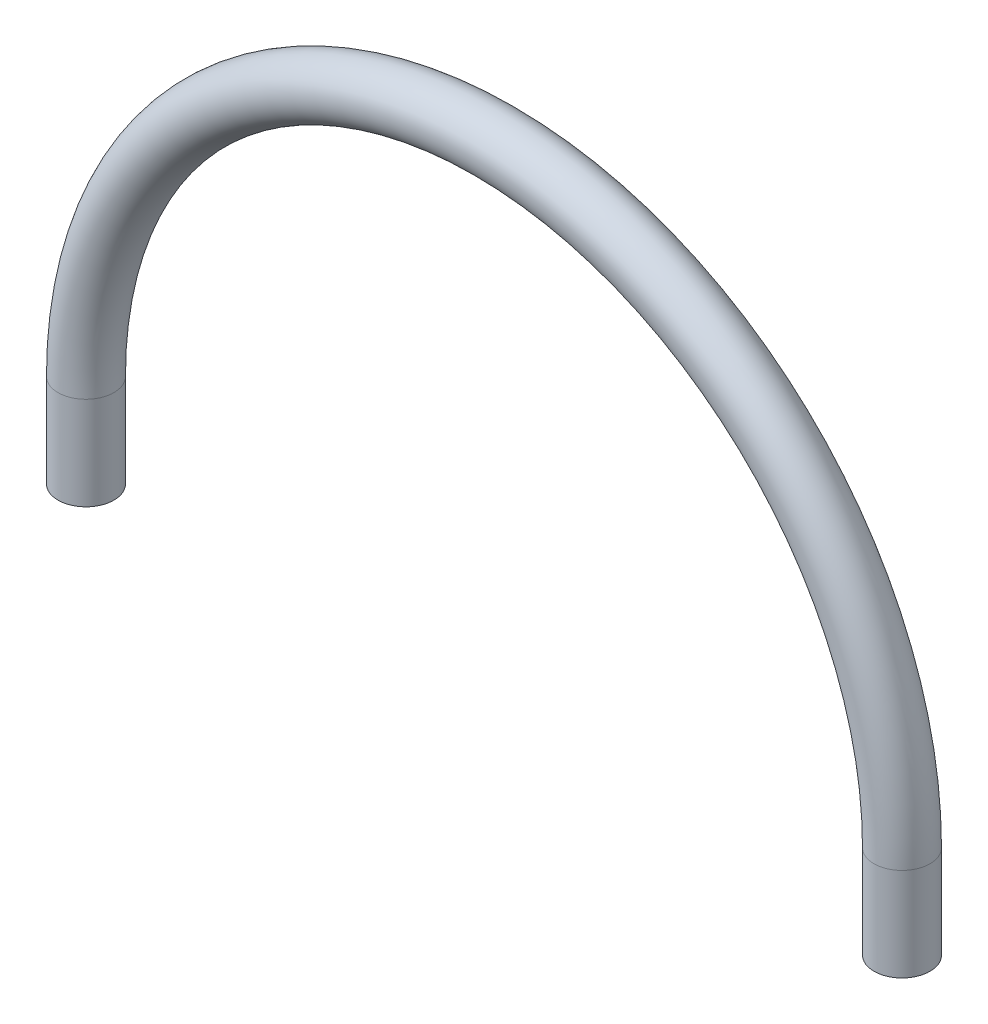
ISO-10303-21;
HEADER;
FILE_DESCRIPTION(('STEP AP214'),'2;1');
FILE_NAME('part.step','',(''),(''),'','','');
FILE_SCHEMA(('AUTOMOTIVE_DESIGN { 1 0 10303 214 1 1 1 1 }'));
ENDSEC;
DATA;
#1=APPLICATION_CONTEXT('core data for automotive mechanical design processes');
#2=APPLICATION_PROTOCOL_DEFINITION('international standard','automotive_design',2000,#1);
#3=PRODUCT_CONTEXT('',#1,'mechanical');
#4=PRODUCT('Part','Part','',(#3));
#5=PRODUCT_RELATED_PRODUCT_CATEGORY('part','',(#4));
#6=PRODUCT_DEFINITION_FORMATION('','',#4);
#7=PRODUCT_DEFINITION_CONTEXT('part definition',#1,'design');
#8=PRODUCT_DEFINITION('design','',#6,#7);
#9=PRODUCT_DEFINITION_SHAPE('','',#8);
#10=(LENGTH_UNIT() NAMED_UNIT(*) SI_UNIT(.MILLI.,.METRE.));
#11=(NAMED_UNIT(*) PLANE_ANGLE_UNIT() SI_UNIT($,.RADIAN.));
#12=(NAMED_UNIT(*) SI_UNIT($,.STERADIAN.) SOLID_ANGLE_UNIT());
#13=UNCERTAINTY_MEASURE_WITH_UNIT(LENGTH_MEASURE(1.E-05),#10,'distance_accuracy_value','');
#14=(GEOMETRIC_REPRESENTATION_CONTEXT(3) GLOBAL_UNCERTAINTY_ASSIGNED_CONTEXT((#13)) GLOBAL_UNIT_ASSIGNED_CONTEXT((#10,
#11,#12)) REPRESENTATION_CONTEXT('',''));
#15=CARTESIAN_POINT('',(0.,0.,0.));
#16=DIRECTION('',(0.,0.,1.));
#17=DIRECTION('',(1.,0.,0.));
#18=AXIS2_PLACEMENT_3D('',#15,#16,#17);
#19=CARTESIAN_POINT('',(-55.626,-12.7,0.));
#20=DIRECTION('',(0.,-1.,0.));
#21=DIRECTION('',(0.,0.,1.));
#22=AXIS2_PLACEMENT_3D('',#19,#20,#21);
#23=PLANE('',#22);
#24=CARTESIAN_POINT('',(-55.626,-12.7,0.));
#25=DIRECTION('',(0.,-1.,0.));
#26=DIRECTION('',(0.,0.,1.));
#27=AXIS2_PLACEMENT_3D('',#24,#25,#26);
#28=CIRCLE('',#27,3.81);
#29=CARTESIAN_POINT('',(-55.626,-12.7,3.81));
#30=VERTEX_POINT('',#29);
#31=EDGE_CURVE('E63',#30,#30,#28,.T.);
#32=ORIENTED_EDGE('',*,*,#31,.T.);
#33=EDGE_LOOP('',(#32));
#34=FACE_BOUND('',#33,.T.);
#35=ADVANCED_FACE('F49',(#34),#23,.T.);
#36=CARTESIAN_POINT('',(55.626,-12.7,0.));
#37=DIRECTION('',(0.,1.,0.));
#38=DIRECTION('',(0.,0.,1.));
#39=AXIS2_PLACEMENT_3D('',#36,#37,#38);
#40=PLANE('',#39);
#41=CARTESIAN_POINT('',(55.626,-12.7,0.));
#42=DIRECTION('',(0.,1.,0.));
#43=DIRECTION('',(0.,0.,1.));
#44=AXIS2_PLACEMENT_3D('',#41,#42,#43);
#45=CIRCLE('',#44,3.81);
#46=CARTESIAN_POINT('',(55.626,-12.7,3.81));
#47=VERTEX_POINT('',#46);
#48=EDGE_CURVE('E11',#47,#47,#45,.T.);
#49=ORIENTED_EDGE('',*,*,#48,.F.);
#50=EDGE_LOOP('',(#49));
#51=FACE_BOUND('',#50,.T.);
#52=ADVANCED_FACE('F73',(#51),#40,.F.);
#53=CARTESIAN_POINT('',(-55.626,-12.7,0.));
#54=DIRECTION('',(0.,1.,0.));
#55=DIRECTION('',(-1.,0.,0.));
#56=AXIS2_PLACEMENT_3D('',#53,#54,#55);
#57=CYLINDRICAL_SURFACE('',#56,3.81);
#58=CARTESIAN_POINT('',(-55.626,0.,0.));
#59=DIRECTION('',(0.,-1.,0.));
#60=DIRECTION('',(0.,0.,1.));
#61=AXIS2_PLACEMENT_3D('',#58,#59,#60);
#62=CIRCLE('',#61,3.81);
#63=CARTESIAN_POINT('',(-59.436,0.,0.));
#64=VERTEX_POINT('',#63);
#65=EDGE_CURVE('E59',#64,#64,#62,.T.);
#66=ORIENTED_EDGE('',*,*,#65,.T.);
#67=EDGE_LOOP('',(#66));
#68=FACE_BOUND('',#67,.T.);
#69=ORIENTED_EDGE('',*,*,#31,.F.);
#70=EDGE_LOOP('',(#69));
#71=FACE_BOUND('',#70,.T.);
#72=ADVANCED_FACE('F70',(#68,#71),#57,.T.);
#73=CARTESIAN_POINT('',(0.,0.,0.));
#74=DIRECTION('',(0.,0.,-1.));
#75=DIRECTION('',(-1.,0.,0.));
#76=AXIS2_PLACEMENT_3D('',#73,#74,#75);
#77=TOROIDAL_SURFACE('',#76,55.626,3.81);
#78=CARTESIAN_POINT('',(55.626,0.,0.));
#79=DIRECTION('',(0.,1.,0.));
#80=DIRECTION('',(0.,0.,1.));
#81=AXIS2_PLACEMENT_3D('',#78,#79,#80);
#82=CIRCLE('',#81,3.81);
#83=CARTESIAN_POINT('',(59.436,0.,0.));
#84=VERTEX_POINT('',#83);
#85=EDGE_CURVE('E55',#84,#84,#82,.T.);
#86=CARTESIAN_POINT('',(0.,0.,0.));
#87=DIRECTION('',(0.,0.,-1.));
#88=DIRECTION('',(-1.,0.,0.));
#89=AXIS2_PLACEMENT_3D('',#86,#87,#88);
#90=CIRCLE('',#89,59.436);
#91=EDGE_CURVE('',#64,#84,#90,.T.);
#92=ORIENTED_EDGE('',*,*,#65,.F.);
#93=ORIENTED_EDGE('',*,*,#85,.T.);
#94=ORIENTED_EDGE('',*,*,#91,.T.);
#95=ORIENTED_EDGE('',*,*,#91,.F.);
#96=EDGE_LOOP('',(#92,#94,#93,#95));
#97=FACE_BOUND('',#96,.T.);
#98=ADVANCED_FACE('F72',(#97),#77,.T.);
#99=CARTESIAN_POINT('',(55.626,0.,0.));
#100=DIRECTION('',(0.,-1.,0.));
#101=DIRECTION('',(1.,0.,0.));
#102=AXIS2_PLACEMENT_3D('',#99,#100,#101);
#103=CYLINDRICAL_SURFACE('',#102,3.81);
#104=ORIENTED_EDGE('',*,*,#48,.T.);
#105=EDGE_LOOP('',(#104));
#106=FACE_BOUND('',#105,.T.);
#107=ORIENTED_EDGE('',*,*,#85,.F.);
#108=EDGE_LOOP('',(#107));
#109=FACE_BOUND('',#108,.T.);
#110=ADVANCED_FACE('F80',(#106,#109),#103,.T.);
#111=CLOSED_SHELL('',(#35,#52,#72,#98,#110));
#112=MANIFOLD_SOLID_BREP('B2',#111);
#113=ADVANCED_BREP_SHAPE_REPRESENTATION('',(#18,#112),#14);
#114=SHAPE_DEFINITION_REPRESENTATION(#9,#113);
ENDSEC;
END-ISO-10303-21;
